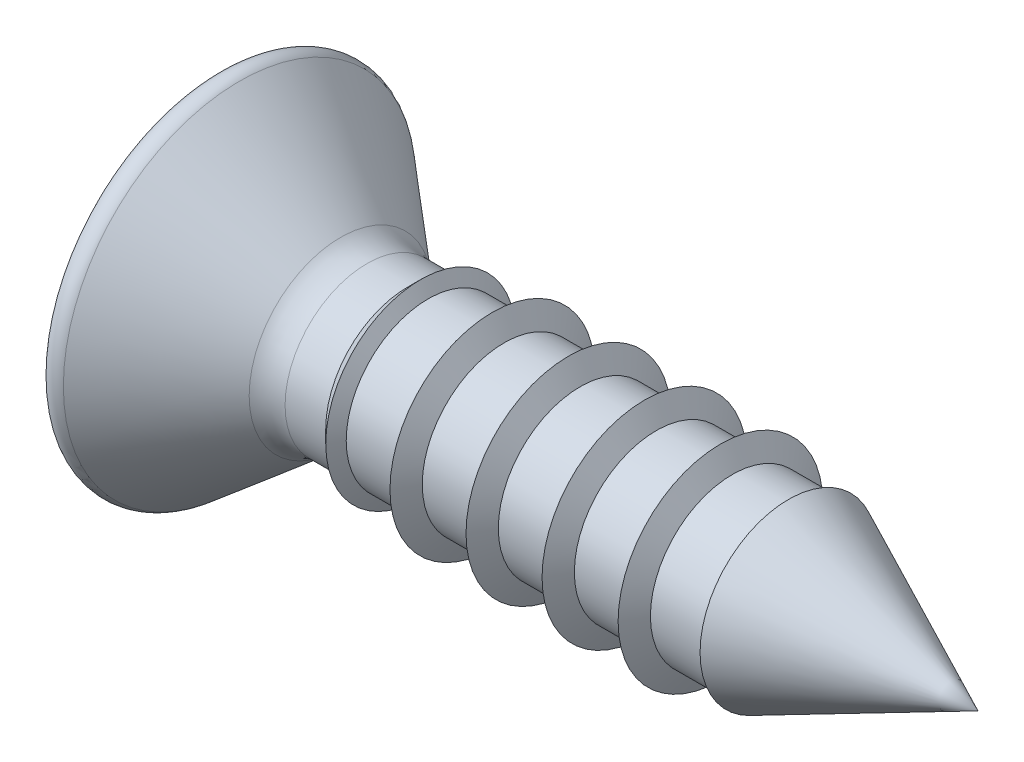
ISO-10303-21;
HEADER;
FILE_DESCRIPTION(('STEP AP214'),'2;1');
FILE_NAME('part.step','',(''),(''),'','','');
FILE_SCHEMA(('AUTOMOTIVE_DESIGN { 1 0 10303 214 1 1 1 1 }'));
ENDSEC;
DATA;
#1=APPLICATION_CONTEXT('core data for automotive mechanical design processes');
#2=APPLICATION_PROTOCOL_DEFINITION('international standard','automotive_design',2000,#1);
#3=PRODUCT_CONTEXT('',#1,'mechanical');
#4=PRODUCT('Part','Part','',(#3));
#5=PRODUCT_RELATED_PRODUCT_CATEGORY('part','',(#4));
#6=PRODUCT_DEFINITION_FORMATION('','',#4);
#7=PRODUCT_DEFINITION_CONTEXT('part definition',#1,'design');
#8=PRODUCT_DEFINITION('design','',#6,#7);
#9=PRODUCT_DEFINITION_SHAPE('','',#8);
#10=(LENGTH_UNIT() NAMED_UNIT(*) SI_UNIT(.MILLI.,.METRE.));
#11=(NAMED_UNIT(*) PLANE_ANGLE_UNIT() SI_UNIT($,.RADIAN.));
#12=(NAMED_UNIT(*) SI_UNIT($,.STERADIAN.) SOLID_ANGLE_UNIT());
#13=UNCERTAINTY_MEASURE_WITH_UNIT(LENGTH_MEASURE(1.E-05),#10,'distance_accuracy_value','');
#14=(GEOMETRIC_REPRESENTATION_CONTEXT(3) GLOBAL_UNCERTAINTY_ASSIGNED_CONTEXT((#13)) GLOBAL_UNIT_ASSIGNED_CONTEXT((#10,
#11,#12)) REPRESENTATION_CONTEXT('',''));
#15=CARTESIAN_POINT('',(0.,0.,0.));
#16=DIRECTION('',(0.,0.,1.));
#17=DIRECTION('',(1.,0.,0.));
#18=AXIS2_PLACEMENT_3D('',#15,#16,#17);
#19=CARTESIAN_POINT('',(9.69585481156726,0.,0.));
#20=DIRECTION('',(1.,0.,0.));
#21=DIRECTION('',(0.,0.,-1.));
#22=AXIS2_PLACEMENT_3D('',#19,#20,#21);
#23=CONICAL_SURFACE('',#22,1.4,1.0471975511966);
#24=CARTESIAN_POINT('',(9.69585481156726,0.,0.));
#25=DIRECTION('',(-1.,0.,0.));
#26=DIRECTION('',(0.,0.,1.));
#27=AXIS2_PLACEMENT_3D('',#24,#25,#26);
#28=CIRCLE('',#27,1.4);
#29=CARTESIAN_POINT('',(9.69585481156726,0.,1.4));
#30=VERTEX_POINT('',#29);
#31=EDGE_CURVE('E564',#30,#30,#28,.T.);
#32=ORIENTED_EDGE('',*,*,#31,.F.);
#33=EDGE_LOOP('',(#32));
#34=FACE_BOUND('',#33,.T.);
#35=CARTESIAN_POINT('',(9.75987904019815,0.,0.));
#36=DIRECTION('',(-1.,0.,0.));
#37=DIRECTION('',(0.,0.,1.));
#38=AXIS2_PLACEMENT_3D('',#35,#36,#37);
#39=CIRCLE('',#38,1.5108932169041);
#40=CARTESIAN_POINT('',(9.75987904019815,0.,1.5108932169041));
#41=VERTEX_POINT('',#40);
#42=EDGE_CURVE('E72',#41,#41,#39,.T.);
#43=ORIENTED_EDGE('',*,*,#42,.T.);
#44=EDGE_LOOP('',(#43));
#45=FACE_BOUND('',#44,.T.);
#46=ADVANCED_FACE('F68',(#34,#45),#23,.T.);
#47=CARTESIAN_POINT('',(3.6,0.,0.));
#48=DIRECTION('',(1.,0.,0.));
#49=DIRECTION('',(0.,0.,-1.));
#50=AXIS2_PLACEMENT_3D('',#47,#48,#49);
#51=CONICAL_SURFACE('',#50,1.75,0.785398163397443);
#52=CARTESIAN_POINT('',(3.25,0.,0.));
#53=DIRECTION('',(-1.,0.,0.));
#54=DIRECTION('',(0.,0.,1.));
#55=AXIS2_PLACEMENT_3D('',#52,#53,#54);
#56=CIRCLE('',#55,1.4);
#57=CARTESIAN_POINT('',(3.25,0.,1.4));
#58=VERTEX_POINT('',#57);
#59=EDGE_CURVE('E369',#58,#58,#56,.T.);
#60=ORIENTED_EDGE('',*,*,#59,.F.);
#61=EDGE_LOOP('',(#60));
#62=FACE_BOUND('',#61,.T.);
#63=CARTESIAN_POINT('',(3.47189110867544,0.,0.));
#64=DIRECTION('',(-1.,0.,0.));
#65=DIRECTION('',(0.,0.,1.));
#66=AXIS2_PLACEMENT_3D('',#63,#64,#65);
#67=CIRCLE('',#66,1.62189110867545);
#68=CARTESIAN_POINT('',(3.47189110867544,0.,1.62189110867545));
#69=VERTEX_POINT('',#68);
#70=EDGE_CURVE('E371',#69,#69,#67,.F.);
#71=ORIENTED_EDGE('',*,*,#70,.F.);
#72=EDGE_LOOP('',(#71));
#73=FACE_BOUND('',#72,.T.);
#74=ADVANCED_FACE('F199',(#62,#73),#51,.T.);
#75=CARTESIAN_POINT('',(2.10482783720576,0.,0.));
#76=DIRECTION('',(-1.,0.,0.));
#77=DIRECTION('',(0.,0.,1.));
#78=AXIS2_PLACEMENT_3D('',#75,#76,#77);
#79=CONICAL_SURFACE('',#78,1.56376888981672,0.698131700797733);
#80=CARTESIAN_POINT('',(2.10482783720576,0.,0.));
#81=DIRECTION('',(-1.,0.,0.));
#82=DIRECTION('',(0.,0.,1.));
#83=AXIS2_PLACEMENT_3D('',#80,#81,#82);
#84=CIRCLE('',#83,1.56376888981672);
#85=CARTESIAN_POINT('',(2.10482783720576,0.,1.56376888981672));
#86=VERTEX_POINT('',#85);
#87=EDGE_CURVE('E477',#86,#86,#84,.T.);
#88=ORIENTED_EDGE('',*,*,#87,.T.);
#89=EDGE_LOOP('',(#88));
#90=FACE_BOUND('',#89,.T.);
#91=CARTESIAN_POINT('',(0.377841150227904,0.,0.));
#92=DIRECTION('',(-1.,0.,0.));
#93=DIRECTION('',(0.,0.,1.));
#94=AXIS2_PLACEMENT_3D('',#91,#92,#93);
#95=CIRCLE('',#94,3.01288278190792);
#96=CARTESIAN_POINT('',(0.377841150227904,0.,3.01288278190792));
#97=VERTEX_POINT('',#96);
#98=EDGE_CURVE('E474',#97,#97,#95,.T.);
#99=ORIENTED_EDGE('',*,*,#98,.F.);
#100=EDGE_LOOP('',(#99));
#101=FACE_BOUND('',#100,.T.);
#102=ADVANCED_FACE('F204',(#90,#101),#79,.T.);
#103=CARTESIAN_POINT('',(0.,0.455,-2.03));
#104=DIRECTION('',(-0.342020143325669,0.,0.939692620785908));
#105=DIRECTION('',(0.939692620785908,0.,0.342020143325669));
#106=AXIS2_PLACEMENT_3D('',#103,#104,#105);
#107=PLANE('',#106);
#108=DIRECTION('',(-0.939692620785908,0.,-0.342020143325669));
#109=VECTOR('',#108,1.);
#110=CARTESIAN_POINT('',(0.,-0.455,-2.03));
#111=LINE('',#110,#109);
#112=CARTESIAN_POINT('',(2.10482783720576,-0.455,-1.26390531900219));
#113=VERTEX_POINT('',#112);
#114=CARTESIAN_POINT('',(0.,-0.455,-2.03));
#115=VERTEX_POINT('',#114);
#116=EDGE_CURVE('E367',#113,#115,#111,.T.);
#117=ORIENTED_EDGE('',*,*,#116,.F.);
#118=DIRECTION('',(0.,1.,0.));
#119=VECTOR('',#118,1.);
#120=CARTESIAN_POINT('',(2.10482783720576,0.455,-1.26390531900219));
#121=LINE('',#120,#119);
#122=CARTESIAN_POINT('',(2.10482783720576,0.455,-1.26390531900219));
#123=VERTEX_POINT('',#122);
#124=EDGE_CURVE('E42',#113,#123,#121,.T.);
#125=ORIENTED_EDGE('',*,*,#124,.T.);
#126=DIRECTION('',(-0.939692620785908,0.,-0.342020143325669));
#127=VECTOR('',#126,1.);
#128=CARTESIAN_POINT('',(1.85860975280969,0.455,-1.35352137286041));
#129=LINE('',#128,#127);
#130=CARTESIAN_POINT('',(0.,0.455,-2.03));
#131=VERTEX_POINT('',#130);
#132=EDGE_CURVE('E442',#123,#131,#129,.T.);
#133=ORIENTED_EDGE('',*,*,#132,.T.);
#134=DIRECTION('',(0.,1.,0.));
#135=VECTOR('',#134,1.);
#136=CARTESIAN_POINT('',(0.,0.455,-2.03));
#137=LINE('',#136,#135);
#138=EDGE_CURVE('E466',#115,#131,#137,.T.);
#139=ORIENTED_EDGE('',*,*,#138,.F.);
#140=EDGE_LOOP('',(#117,#125,#133,#139));
#141=FACE_BOUND('',#140,.T.);
#142=ADVANCED_FACE('F282',(#141),#107,.T.);
#143=CARTESIAN_POINT('',(2.10482783720576,0.455,-0.455000000000001));
#144=DIRECTION('',(-1.,0.,0.));
#145=DIRECTION('',(0.,0.,1.));
#146=AXIS2_PLACEMENT_3D('',#143,#144,#145);
#147=PLANE('',#146);
#148=DIRECTION('',(0.,-0.707106781186548,-0.707106781186547));
#149=VECTOR('',#148,1.);
#150=CARTESIAN_POINT('',(2.10482783720576,-0.861,0.455));
#151=LINE('',#150,#149);
#152=CARTESIAN_POINT('',(2.10482783720576,-0.455,0.861));
#153=VERTEX_POINT('',#152);
#154=CARTESIAN_POINT('',(2.10482783720576,-0.861,0.455));
#155=VERTEX_POINT('',#154);
#156=EDGE_CURVE('E391',#153,#155,#151,.T.);
#157=ORIENTED_EDGE('',*,*,#156,.F.);
#158=DIRECTION('',(0.,0.,-1.));
#159=VECTOR('',#158,1.);
#160=CARTESIAN_POINT('',(2.10482783720576,-0.455,0.454999999999999));
#161=LINE('',#160,#159);
#162=CARTESIAN_POINT('',(2.10482783720576,-0.455,1.26390531900219));
#163=VERTEX_POINT('',#162);
#164=EDGE_CURVE('E429',#163,#153,#161,.T.);
#165=ORIENTED_EDGE('',*,*,#164,.F.);
#166=DIRECTION('',(0.,-1.,0.));
#167=VECTOR('',#166,1.);
#168=CARTESIAN_POINT('',(2.10482783720576,0.455,1.26390531900219));
#169=LINE('',#168,#167);
#170=CARTESIAN_POINT('',(2.10482783720576,0.455,1.26390531900219));
#171=VERTEX_POINT('',#170);
#172=EDGE_CURVE('E349',#171,#163,#169,.T.);
#173=ORIENTED_EDGE('',*,*,#172,.F.);
#174=DIRECTION('',(0.,0.,1.));
#175=VECTOR('',#174,1.);
#176=CARTESIAN_POINT('',(2.10482783720576,0.455,0.455));
#177=LINE('',#176,#175);
#178=CARTESIAN_POINT('',(2.10482783720576,0.455,0.861));
#179=VERTEX_POINT('',#178);
#180=EDGE_CURVE('E427',#179,#171,#177,.T.);
#181=ORIENTED_EDGE('',*,*,#180,.F.);
#182=DIRECTION('',(0.,-0.707106781186548,0.707106781186547));
#183=VECTOR('',#182,1.);
#184=CARTESIAN_POINT('',(2.10482783720576,0.861,0.455));
#185=LINE('',#184,#183);
#186=CARTESIAN_POINT('',(2.10482783720576,0.861,0.455));
#187=VERTEX_POINT('',#186);
#188=EDGE_CURVE('E412',#187,#179,#185,.T.);
#189=ORIENTED_EDGE('',*,*,#188,.F.);
#190=DIRECTION('',(0.,-1.,0.));
#191=VECTOR('',#190,1.);
#192=CARTESIAN_POINT('',(2.10482783720576,2.03,0.455));
#193=LINE('',#192,#191);
#194=CARTESIAN_POINT('',(2.10482783720576,1.26390531900219,0.455));
#195=VERTEX_POINT('',#194);
#196=EDGE_CURVE('E423',#195,#187,#193,.T.);
#197=ORIENTED_EDGE('',*,*,#196,.F.);
#198=DIRECTION('',(0.,0.,1.));
#199=VECTOR('',#198,1.);
#200=CARTESIAN_POINT('',(2.10482783720576,1.26390531900219,-0.455000000000001));
#201=LINE('',#200,#199);
#202=CARTESIAN_POINT('',(2.10482783720576,1.26390531900219,-0.455));
#203=VERTEX_POINT('',#202);
#204=EDGE_CURVE('E77',#203,#195,#201,.T.);
#205=ORIENTED_EDGE('',*,*,#204,.F.);
#206=DIRECTION('',(0.,1.,0.));
#207=VECTOR('',#206,1.);
#208=CARTESIAN_POINT('',(2.10482783720576,2.03,-0.455));
#209=LINE('',#208,#207);
#210=CARTESIAN_POINT('',(2.10482783720576,0.861,-0.455));
#211=VERTEX_POINT('',#210);
#212=EDGE_CURVE('E421',#211,#203,#209,.T.);
#213=ORIENTED_EDGE('',*,*,#212,.F.);
#214=DIRECTION('',(0.,0.707106781186548,0.707106781186547));
#215=VECTOR('',#214,1.);
#216=CARTESIAN_POINT('',(2.10482783720576,0.861,-0.455));
#217=LINE('',#216,#215);
#218=CARTESIAN_POINT('',(2.10482783720576,0.455,-0.861));
#219=VERTEX_POINT('',#218);
#220=EDGE_CURVE('E85',#219,#211,#217,.T.);
#221=ORIENTED_EDGE('',*,*,#220,.F.);
#222=DIRECTION('',(0.,0.,1.));
#223=VECTOR('',#222,1.);
#224=CARTESIAN_POINT('',(2.10482783720576,0.455,-2.03));
#225=LINE('',#224,#223);
#226=EDGE_CURVE('E439',#123,#219,#225,.T.);
#227=ORIENTED_EDGE('',*,*,#226,.F.);
#228=ORIENTED_EDGE('',*,*,#124,.F.);
#229=DIRECTION('',(0.,0.,-1.));
#230=VECTOR('',#229,1.);
#231=CARTESIAN_POINT('',(2.10482783720576,-0.455,-2.03));
#232=LINE('',#231,#230);
#233=CARTESIAN_POINT('',(2.10482783720576,-0.455,-0.861));
#234=VERTEX_POINT('',#233);
#235=EDGE_CURVE('E437',#234,#113,#232,.T.);
#236=ORIENTED_EDGE('',*,*,#235,.F.);
#237=DIRECTION('',(0.,0.707106781186548,-0.707106781186547));
#238=VECTOR('',#237,1.);
#239=CARTESIAN_POINT('',(2.10482783720576,-0.861,-0.455));
#240=LINE('',#239,#238);
#241=CARTESIAN_POINT('',(2.10482783720576,-0.861,-0.455));
#242=VERTEX_POINT('',#241);
#243=EDGE_CURVE('E395',#242,#234,#240,.T.);
#244=ORIENTED_EDGE('',*,*,#243,.F.);
#245=DIRECTION('',(0.,1.,0.));
#246=VECTOR('',#245,1.);
#247=CARTESIAN_POINT('',(2.10482783720576,-0.455,-0.455));
#248=LINE('',#247,#246);
#249=CARTESIAN_POINT('',(2.10482783720576,-1.26390531900219,-0.455));
#250=VERTEX_POINT('',#249);
#251=EDGE_CURVE('E434',#250,#242,#248,.T.);
#252=ORIENTED_EDGE('',*,*,#251,.F.);
#253=DIRECTION('',(0.,0.,-1.));
#254=VECTOR('',#253,1.);
#255=CARTESIAN_POINT('',(2.10482783720576,-1.26390531900219,-0.455000000000001));
#256=LINE('',#255,#254);
#257=CARTESIAN_POINT('',(2.10482783720576,-1.26390531900219,0.455));
#258=VERTEX_POINT('',#257);
#259=EDGE_CURVE('E93',#258,#250,#256,.T.);
#260=ORIENTED_EDGE('',*,*,#259,.F.);
#261=DIRECTION('',(0.,-1.,0.));
#262=VECTOR('',#261,1.);
#263=CARTESIAN_POINT('',(2.10482783720576,-0.455,0.454999999999999));
#264=LINE('',#263,#262);
#265=EDGE_CURVE('E432',#155,#258,#264,.T.);
#266=ORIENTED_EDGE('',*,*,#265,.F.);
#267=EDGE_LOOP('',(#157,#165,#173,#181,#189,#197,#205,#213,#221,#227,#228,#236,#244,#252,#260,#266));
#268=FACE_BOUND('',#267,.T.);
#269=ADVANCED_FACE('F278',(#268),#147,.T.);
#270=CARTESIAN_POINT('',(0.,2.03,-0.455));
#271=DIRECTION('',(-0.342020143325669,-0.939692620785908,0.));
#272=DIRECTION('',(0.939692620785908,-0.342020143325669,0.));
#273=AXIS2_PLACEMENT_3D('',#270,#271,#272);
#274=PLANE('',#273);
#275=DIRECTION('',(-0.939692620785908,0.342020143325669,0.));
#276=VECTOR('',#275,1.);
#277=CARTESIAN_POINT('',(0.,2.03,-0.455));
#278=LINE('',#277,#276);
#279=CARTESIAN_POINT('',(0.,2.03,-0.455));
#280=VERTEX_POINT('',#279);
#281=EDGE_CURVE('E357',#203,#280,#278,.T.);
#282=ORIENTED_EDGE('',*,*,#281,.F.);
#283=ORIENTED_EDGE('',*,*,#204,.T.);
#284=DIRECTION('',(-0.939692620785908,0.342020143325669,0.));
#285=VECTOR('',#284,1.);
#286=CARTESIAN_POINT('',(1.85860975280969,1.35352137286041,0.455));
#287=LINE('',#286,#285);
#288=CARTESIAN_POINT('',(0.,2.03,0.455));
#289=VERTEX_POINT('',#288);
#290=EDGE_CURVE('E354',#195,#289,#287,.T.);
#291=ORIENTED_EDGE('',*,*,#290,.T.);
#292=DIRECTION('',(0.,0.,1.));
#293=VECTOR('',#292,1.);
#294=CARTESIAN_POINT('',(0.,2.03,-0.455));
#295=LINE('',#294,#293);
#296=EDGE_CURVE('E444',#280,#289,#295,.T.);
#297=ORIENTED_EDGE('',*,*,#296,.F.);
#298=EDGE_LOOP('',(#282,#283,#291,#297));
#299=FACE_BOUND('',#298,.T.);
#300=ADVANCED_FACE('F281',(#299),#274,.T.);
#301=CARTESIAN_POINT('',(0.,0.455,2.03));
#302=DIRECTION('',(-0.342020143325669,0.,-0.939692620785908));
#303=DIRECTION('',(-0.939692620785908,0.,0.342020143325669));
#304=AXIS2_PLACEMENT_3D('',#301,#302,#303);
#305=PLANE('',#304);
#306=DIRECTION('',(-0.939692620785908,0.,0.342020143325669));
#307=VECTOR('',#306,1.);
#308=CARTESIAN_POINT('',(0.,0.455,2.03));
#309=LINE('',#308,#307);
#310=CARTESIAN_POINT('',(0.,0.455,2.03));
#311=VERTEX_POINT('',#310);
#312=EDGE_CURVE('E347',#171,#311,#309,.T.);
#313=ORIENTED_EDGE('',*,*,#312,.F.);
#314=ORIENTED_EDGE('',*,*,#172,.T.);
#315=DIRECTION('',(-0.939692620785908,0.,0.342020143325669));
#316=VECTOR('',#315,1.);
#317=CARTESIAN_POINT('',(2.36480499543784,-0.455,1.1692813718166));
#318=LINE('',#317,#316);
#319=CARTESIAN_POINT('',(0.,-0.455,2.03));
#320=VERTEX_POINT('',#319);
#321=EDGE_CURVE('E355',#163,#320,#318,.T.);
#322=ORIENTED_EDGE('',*,*,#321,.T.);
#323=DIRECTION('',(0.,-1.,0.));
#324=VECTOR('',#323,1.);
#325=CARTESIAN_POINT('',(0.,0.455,2.03));
#326=LINE('',#325,#324);
#327=EDGE_CURVE('E352',#311,#320,#326,.T.);
#328=ORIENTED_EDGE('',*,*,#327,.F.);
#329=EDGE_LOOP('',(#313,#314,#322,#328));
#330=FACE_BOUND('',#329,.T.);
#331=ADVANCED_FACE('F337',(#330),#305,.T.);
#332=CARTESIAN_POINT('',(0.,-2.03,-0.455));
#333=DIRECTION('',(-0.342020143325669,0.939692620785908,0.));
#334=DIRECTION('',(-0.939692620785908,-0.342020143325669,0.));
#335=AXIS2_PLACEMENT_3D('',#332,#333,#334);
#336=PLANE('',#335);
#337=DIRECTION('',(-0.939692620785908,-0.342020143325669,0.));
#338=VECTOR('',#337,1.);
#339=CARTESIAN_POINT('',(0.,-2.03,0.455));
#340=LINE('',#339,#338);
#341=CARTESIAN_POINT('',(0.,-2.03,0.455));
#342=VERTEX_POINT('',#341);
#343=EDGE_CURVE('E359',#258,#342,#340,.T.);
#344=ORIENTED_EDGE('',*,*,#343,.F.);
#345=ORIENTED_EDGE('',*,*,#259,.T.);
#346=DIRECTION('',(-0.939692620785908,-0.342020143325669,0.));
#347=VECTOR('',#346,1.);
#348=CARTESIAN_POINT('',(2.36480499543784,-1.1692813718166,-0.455));
#349=LINE('',#348,#347);
#350=CARTESIAN_POINT('',(0.,-2.03,-0.455));
#351=VERTEX_POINT('',#350);
#352=EDGE_CURVE('E365',#250,#351,#349,.T.);
#353=ORIENTED_EDGE('',*,*,#352,.T.);
#354=DIRECTION('',(0.,0.,-1.));
#355=VECTOR('',#354,1.);
#356=CARTESIAN_POINT('',(0.,-2.03,-0.455));
#357=LINE('',#356,#355);
#358=EDGE_CURVE('E458',#342,#351,#357,.T.);
#359=ORIENTED_EDGE('',*,*,#358,.F.);
#360=EDGE_LOOP('',(#344,#345,#353,#359));
#361=FACE_BOUND('',#360,.T.);
#362=ADVANCED_FACE('F70',(#361),#336,.T.);
#363=CARTESIAN_POINT('',(0.,0.,0.));
#364=DIRECTION('',(1.,0.,0.));
#365=DIRECTION('',(0.,0.,-1.));
#366=AXIS2_PLACEMENT_3D('',#363,#364,#365);
#367=PLANE('',#366);
#368=CARTESIAN_POINT('',(0.,0.,0.));
#369=DIRECTION('',(-1.,0.,0.));
#370=DIRECTION('',(0.,0.,1.));
#371=AXIS2_PLACEMENT_3D('',#368,#369,#370);
#372=CIRCLE('',#371,2.83669255999055);
#373=CARTESIAN_POINT('',(0.,0.,2.83669255999055));
#374=VERTEX_POINT('',#373);
#375=EDGE_CURVE('E471',#374,#374,#372,.T.);
#376=ORIENTED_EDGE('',*,*,#375,.T.);
#377=EDGE_LOOP('',(#376));
#378=FACE_BOUND('',#377,.T.);
#379=DIRECTION('',(0.,0.,-1.));
#380=VECTOR('',#379,1.);
#381=CARTESIAN_POINT('',(0.,-0.455,0.454999999999999));
#382=LINE('',#381,#380);
#383=CARTESIAN_POINT('',(0.,-0.455,0.861));
#384=VERTEX_POINT('',#383);
#385=EDGE_CURVE('E453',#320,#384,#382,.T.);
#386=ORIENTED_EDGE('',*,*,#385,.T.);
#387=DIRECTION('',(0.,0.707106781186548,0.707106781186547));
#388=VECTOR('',#387,1.);
#389=CARTESIAN_POINT('',(0.,-0.861,0.455));
#390=LINE('',#389,#388);
#391=CARTESIAN_POINT('',(0.,-0.861,0.455));
#392=VERTEX_POINT('',#391);
#393=EDGE_CURVE('E373',#392,#384,#390,.T.);
#394=ORIENTED_EDGE('',*,*,#393,.F.);
#395=DIRECTION('',(0.,-1.,0.));
#396=VECTOR('',#395,1.);
#397=CARTESIAN_POINT('',(0.,-0.455,0.454999999999999));
#398=LINE('',#397,#396);
#399=EDGE_CURVE('E456',#392,#342,#398,.T.);
#400=ORIENTED_EDGE('',*,*,#399,.T.);
#401=ORIENTED_EDGE('',*,*,#358,.T.);
#402=DIRECTION('',(0.,1.,0.));
#403=VECTOR('',#402,1.);
#404=CARTESIAN_POINT('',(0.,-0.455,-0.455));
#405=LINE('',#404,#403);
#406=CARTESIAN_POINT('',(0.,-0.861,-0.455));
#407=VERTEX_POINT('',#406);
#408=EDGE_CURVE('E461',#351,#407,#405,.T.);
#409=ORIENTED_EDGE('',*,*,#408,.T.);
#410=DIRECTION('',(0.,-0.707106781186548,0.707106781186547));
#411=VECTOR('',#410,1.);
#412=CARTESIAN_POINT('',(0.,-0.861,-0.455));
#413=LINE('',#412,#411);
#414=CARTESIAN_POINT('',(0.,-0.455,-0.861));
#415=VERTEX_POINT('',#414);
#416=EDGE_CURVE('E394',#415,#407,#413,.T.);
#417=ORIENTED_EDGE('',*,*,#416,.F.);
#418=DIRECTION('',(0.,0.,-1.));
#419=VECTOR('',#418,1.);
#420=CARTESIAN_POINT('',(0.,-0.455,-2.03));
#421=LINE('',#420,#419);
#422=EDGE_CURVE('E464',#415,#115,#421,.T.);
#423=ORIENTED_EDGE('',*,*,#422,.T.);
#424=ORIENTED_EDGE('',*,*,#138,.T.);
#425=DIRECTION('',(0.,0.,1.));
#426=VECTOR('',#425,1.);
#427=CARTESIAN_POINT('',(0.,0.455,-2.03));
#428=LINE('',#427,#426);
#429=CARTESIAN_POINT('',(0.,0.455,-0.861));
#430=VERTEX_POINT('',#429);
#431=EDGE_CURVE('E424',#131,#430,#428,.T.);
#432=ORIENTED_EDGE('',*,*,#431,.T.);
#433=DIRECTION('',(0.,-0.707106781186548,-0.707106781186547));
#434=VECTOR('',#433,1.);
#435=CARTESIAN_POINT('',(0.,0.861,-0.455));
#436=LINE('',#435,#434);
#437=CARTESIAN_POINT('',(0.,0.861,-0.455));
#438=VERTEX_POINT('',#437);
#439=EDGE_CURVE('E397',#438,#430,#436,.T.);
#440=ORIENTED_EDGE('',*,*,#439,.F.);
#441=DIRECTION('',(0.,1.,0.));
#442=VECTOR('',#441,1.);
#443=CARTESIAN_POINT('',(0.,2.03,-0.455));
#444=LINE('',#443,#442);
#445=EDGE_CURVE('E414',#438,#280,#444,.T.);
#446=ORIENTED_EDGE('',*,*,#445,.T.);
#447=ORIENTED_EDGE('',*,*,#296,.T.);
#448=DIRECTION('',(0.,-1.,0.));
#449=VECTOR('',#448,1.);
#450=CARTESIAN_POINT('',(0.,2.03,0.455));
#451=LINE('',#450,#449);
#452=CARTESIAN_POINT('',(0.,0.861,0.455));
#453=VERTEX_POINT('',#452);
#454=EDGE_CURVE('E447',#289,#453,#451,.T.);
#455=ORIENTED_EDGE('',*,*,#454,.T.);
#456=DIRECTION('',(0.,0.707106781186548,-0.707106781186547));
#457=VECTOR('',#456,1.);
#458=CARTESIAN_POINT('',(0.,0.861,0.455));
#459=LINE('',#458,#457);
#460=CARTESIAN_POINT('',(0.,0.455,0.861));
#461=VERTEX_POINT('',#460);
#462=EDGE_CURVE('E411',#461,#453,#459,.T.);
#463=ORIENTED_EDGE('',*,*,#462,.F.);
#464=DIRECTION('',(0.,0.,1.));
#465=VECTOR('',#464,1.);
#466=CARTESIAN_POINT('',(0.,0.455,0.455));
#467=LINE('',#466,#465);
#468=EDGE_CURVE('E450',#461,#311,#467,.T.);
#469=ORIENTED_EDGE('',*,*,#468,.T.);
#470=ORIENTED_EDGE('',*,*,#327,.T.);
#471=EDGE_LOOP('',(#386,#394,#400,#401,#409,#417,#423,#424,#432,#440,#446,#447,#455,#463,#469,#470));
#472=FACE_BOUND('',#471,.T.);
#473=ADVANCED_FACE('F315',(#378,#472),#367,.F.);
#474=CARTESIAN_POINT('',(0.,0.,0.));
#475=DIRECTION('',(-1.,0.,0.));
#476=DIRECTION('',(0.,0.,1.));
#477=AXIS2_PLACEMENT_3D('',#474,#475,#476);
#478=CYLINDRICAL_SURFACE('',#477,1.4);
#479=CARTESIAN_POINT('',(2.55477916398634,0.,0.));
#480=DIRECTION('',(-1.,0.,0.));
#481=DIRECTION('',(0.,0.,1.));
#482=AXIS2_PLACEMENT_3D('',#479,#480,#481);
#483=CIRCLE('',#482,1.4);
#484=CARTESIAN_POINT('',(2.55477916398634,0.,1.4));
#485=VERTEX_POINT('',#484);
#486=EDGE_CURVE('E480',#485,#485,#483,.T.);
#487=ORIENTED_EDGE('',*,*,#486,.F.);
#488=EDGE_LOOP('',(#487));
#489=FACE_BOUND('',#488,.T.);
#490=ORIENTED_EDGE('',*,*,#59,.T.);
#491=EDGE_LOOP('',(#490));
#492=FACE_BOUND('',#491,.T.);
#493=ADVANCED_FACE('F318',(#489,#492),#478,.T.);
#494=CARTESIAN_POINT('',(2.55477916398634,0.,0.));
#495=DIRECTION('',(-1.,0.,0.));
#496=DIRECTION('',(0.,0.,1.));
#497=AXIS2_PLACEMENT_3D('',#494,#495,#496);
#498=TOROIDAL_SURFACE('',#497,2.1,0.7);
#499=ORIENTED_EDGE('',*,*,#87,.F.);
#500=EDGE_LOOP('',(#499));
#501=FACE_BOUND('',#500,.T.);
#502=ORIENTED_EDGE('',*,*,#486,.T.);
#503=EDGE_LOOP('',(#502));
#504=FACE_BOUND('',#503,.T.);
#505=ADVANCED_FACE('F322',(#501,#504),#498,.F.);
#506=CARTESIAN_POINT('',(0.23,0.,0.));
#507=DIRECTION('',(-1.,0.,0.));
#508=DIRECTION('',(0.,0.,1.));
#509=AXIS2_PLACEMENT_3D('',#506,#507,#508);
#510=TOROIDAL_SURFACE('',#509,2.83669255999055,0.23);
#511=ORIENTED_EDGE('',*,*,#375,.F.);
#512=EDGE_LOOP('',(#511));
#513=FACE_BOUND('',#512,.T.);
#514=ORIENTED_EDGE('',*,*,#98,.T.);
#515=EDGE_LOOP('',(#514));
#516=FACE_BOUND('',#515,.T.);
#517=ADVANCED_FACE('F313',(#513,#516),#510,.T.);
#518=CARTESIAN_POINT('',(2.10482783720576,2.03,-0.455));
#519=DIRECTION('',(0.,0.,1.));
#520=DIRECTION('',(1.,0.,0.));
#521=AXIS2_PLACEMENT_3D('',#518,#519,#520);
#522=PLANE('',#521);
#523=DIRECTION('',(-1.,0.,0.));
#524=VECTOR('',#523,1.);
#525=CARTESIAN_POINT('',(2.67899854352924,0.861,-0.455));
#526=LINE('',#525,#524);
#527=EDGE_CURVE('E405',#211,#438,#526,.T.);
#528=ORIENTED_EDGE('',*,*,#527,.F.);
#529=ORIENTED_EDGE('',*,*,#212,.T.);
#530=ORIENTED_EDGE('',*,*,#281,.T.);
#531=ORIENTED_EDGE('',*,*,#445,.F.);
#532=EDGE_LOOP('',(#528,#529,#530,#531));
#533=FACE_BOUND('',#532,.T.);
#534=ADVANCED_FACE('F309',(#533),#522,.T.);
#535=CARTESIAN_POINT('',(2.10482783720576,2.03,0.455));
#536=DIRECTION('',(0.,0.,-1.));
#537=DIRECTION('',(0.,1.,0.));
#538=AXIS2_PLACEMENT_3D('',#535,#536,#537);
#539=PLANE('',#538);
#540=DIRECTION('',(-1.,0.,0.));
#541=VECTOR('',#540,1.);
#542=CARTESIAN_POINT('',(2.67899854352924,0.861,0.455));
#543=LINE('',#542,#541);
#544=EDGE_CURVE('E415',#187,#453,#543,.T.);
#545=ORIENTED_EDGE('',*,*,#544,.T.);
#546=ORIENTED_EDGE('',*,*,#454,.F.);
#547=ORIENTED_EDGE('',*,*,#290,.F.);
#548=ORIENTED_EDGE('',*,*,#196,.T.);
#549=EDGE_LOOP('',(#545,#546,#547,#548));
#550=FACE_BOUND('',#549,.T.);
#551=ADVANCED_FACE('F305',(#550),#539,.T.);
#552=CARTESIAN_POINT('',(2.10482783720576,0.455,0.455));
#553=DIRECTION('',(0.,-1.,0.));
#554=DIRECTION('',(0.,0.,-1.));
#555=AXIS2_PLACEMENT_3D('',#552,#553,#554);
#556=PLANE('',#555);
#557=DIRECTION('',(-1.,0.,0.));
#558=VECTOR('',#557,1.);
#559=CARTESIAN_POINT('',(2.67899854352924,0.455,0.861));
#560=LINE('',#559,#558);
#561=EDGE_CURVE('E417',#179,#461,#560,.T.);
#562=ORIENTED_EDGE('',*,*,#561,.F.);
#563=ORIENTED_EDGE('',*,*,#180,.T.);
#564=ORIENTED_EDGE('',*,*,#312,.T.);
#565=ORIENTED_EDGE('',*,*,#468,.F.);
#566=EDGE_LOOP('',(#562,#563,#564,#565));
#567=FACE_BOUND('',#566,.T.);
#568=ADVANCED_FACE('F301',(#567),#556,.T.);
#569=CARTESIAN_POINT('',(2.10482783720576,-0.455,0.454999999999999));
#570=DIRECTION('',(0.,1.,0.));
#571=DIRECTION('',(0.,0.,1.));
#572=AXIS2_PLACEMENT_3D('',#569,#570,#571);
#573=PLANE('',#572);
#574=DIRECTION('',(-1.,0.,0.));
#575=VECTOR('',#574,1.);
#576=CARTESIAN_POINT('',(2.67899854352924,-0.455,0.861));
#577=LINE('',#576,#575);
#578=EDGE_CURVE('E388',#153,#384,#577,.T.);
#579=ORIENTED_EDGE('',*,*,#578,.T.);
#580=ORIENTED_EDGE('',*,*,#385,.F.);
#581=ORIENTED_EDGE('',*,*,#321,.F.);
#582=ORIENTED_EDGE('',*,*,#164,.T.);
#583=EDGE_LOOP('',(#579,#580,#581,#582));
#584=FACE_BOUND('',#583,.T.);
#585=ADVANCED_FACE('F297',(#584),#573,.T.);
#586=CARTESIAN_POINT('',(2.10482783720576,-0.455,0.454999999999999));
#587=DIRECTION('',(0.,0.,-1.));
#588=DIRECTION('',(0.,1.,0.));
#589=AXIS2_PLACEMENT_3D('',#586,#587,#588);
#590=PLANE('',#589);
#591=DIRECTION('',(-1.,0.,0.));
#592=VECTOR('',#591,1.);
#593=CARTESIAN_POINT('',(2.67899854352924,-0.861,0.455));
#594=LINE('',#593,#592);
#595=EDGE_CURVE('E377',#155,#392,#594,.T.);
#596=ORIENTED_EDGE('',*,*,#595,.F.);
#597=ORIENTED_EDGE('',*,*,#265,.T.);
#598=ORIENTED_EDGE('',*,*,#343,.T.);
#599=ORIENTED_EDGE('',*,*,#399,.F.);
#600=EDGE_LOOP('',(#596,#597,#598,#599));
#601=FACE_BOUND('',#600,.T.);
#602=ADVANCED_FACE('F293',(#601),#590,.T.);
#603=CARTESIAN_POINT('',(2.10482783720576,-0.455,-0.455));
#604=DIRECTION('',(0.,0.,1.));
#605=DIRECTION('',(1.,0.,0.));
#606=AXIS2_PLACEMENT_3D('',#603,#604,#605);
#607=PLANE('',#606);
#608=DIRECTION('',(-1.,0.,0.));
#609=VECTOR('',#608,1.);
#610=CARTESIAN_POINT('',(2.67899854352924,-0.861,-0.455));
#611=LINE('',#610,#609);
#612=EDGE_CURVE('E398',#242,#407,#611,.T.);
#613=ORIENTED_EDGE('',*,*,#612,.T.);
#614=ORIENTED_EDGE('',*,*,#408,.F.);
#615=ORIENTED_EDGE('',*,*,#352,.F.);
#616=ORIENTED_EDGE('',*,*,#251,.T.);
#617=EDGE_LOOP('',(#613,#614,#615,#616));
#618=FACE_BOUND('',#617,.T.);
#619=ADVANCED_FACE('F289',(#618),#607,.T.);
#620=CARTESIAN_POINT('',(2.10482783720576,-0.455,-2.03));
#621=DIRECTION('',(0.,1.,0.));
#622=DIRECTION('',(0.,0.,1.));
#623=AXIS2_PLACEMENT_3D('',#620,#621,#622);
#624=PLANE('',#623);
#625=DIRECTION('',(-1.,0.,0.));
#626=VECTOR('',#625,1.);
#627=CARTESIAN_POINT('',(2.67899854352924,-0.455,-0.861));
#628=LINE('',#627,#626);
#629=EDGE_CURVE('E400',#234,#415,#628,.T.);
#630=ORIENTED_EDGE('',*,*,#629,.F.);
#631=ORIENTED_EDGE('',*,*,#235,.T.);
#632=ORIENTED_EDGE('',*,*,#116,.T.);
#633=ORIENTED_EDGE('',*,*,#422,.F.);
#634=EDGE_LOOP('',(#630,#631,#632,#633));
#635=FACE_BOUND('',#634,.T.);
#636=ADVANCED_FACE('F285',(#635),#624,.T.);
#637=CARTESIAN_POINT('',(2.10482783720576,0.455,-2.03));
#638=DIRECTION('',(0.,-1.,0.));
#639=DIRECTION('',(0.,0.,-1.));
#640=AXIS2_PLACEMENT_3D('',#637,#638,#639);
#641=PLANE('',#640);
#642=DIRECTION('',(-1.,0.,0.));
#643=VECTOR('',#642,1.);
#644=CARTESIAN_POINT('',(2.67899854352924,0.455,-0.861));
#645=LINE('',#644,#643);
#646=EDGE_CURVE('E406',#219,#430,#645,.T.);
#647=ORIENTED_EDGE('',*,*,#646,.T.);
#648=ORIENTED_EDGE('',*,*,#431,.F.);
#649=ORIENTED_EDGE('',*,*,#132,.F.);
#650=ORIENTED_EDGE('',*,*,#226,.T.);
#651=EDGE_LOOP('',(#647,#648,#649,#650));
#652=FACE_BOUND('',#651,.T.);
#653=ADVANCED_FACE('F276',(#652),#641,.T.);
#654=CARTESIAN_POINT('',(2.67899854352924,0.861,0.455));
#655=DIRECTION('',(0.,0.707106781186547,0.707106781186548));
#656=DIRECTION('',(0.,-0.707106781186548,0.707106781186547));
#657=AXIS2_PLACEMENT_3D('',#654,#655,#656);
#658=PLANE('',#657);
#659=ORIENTED_EDGE('',*,*,#188,.T.);
#660=ORIENTED_EDGE('',*,*,#561,.T.);
#661=ORIENTED_EDGE('',*,*,#462,.T.);
#662=ORIENTED_EDGE('',*,*,#544,.F.);
#663=EDGE_LOOP('',(#659,#660,#661,#662));
#664=FACE_BOUND('',#663,.T.);
#665=ADVANCED_FACE('F272',(#664),#658,.F.);
#666=CARTESIAN_POINT('',(2.67899854352924,0.861,-0.455));
#667=DIRECTION('',(0.,0.707106781186547,-0.707106781186548));
#668=DIRECTION('',(0.,0.707106781186548,0.707106781186547));
#669=AXIS2_PLACEMENT_3D('',#666,#667,#668);
#670=PLANE('',#669);
#671=ORIENTED_EDGE('',*,*,#220,.T.);
#672=ORIENTED_EDGE('',*,*,#527,.T.);
#673=ORIENTED_EDGE('',*,*,#439,.T.);
#674=ORIENTED_EDGE('',*,*,#646,.F.);
#675=EDGE_LOOP('',(#671,#672,#673,#674));
#676=FACE_BOUND('',#675,.T.);
#677=ADVANCED_FACE('F268',(#676),#670,.F.);
#678=CARTESIAN_POINT('',(2.67899854352924,-0.861,-0.455));
#679=DIRECTION('',(0.,-0.707106781186547,-0.707106781186548));
#680=DIRECTION('',(0.,0.707106781186548,-0.707106781186547));
#681=AXIS2_PLACEMENT_3D('',#678,#679,#680);
#682=PLANE('',#681);
#683=ORIENTED_EDGE('',*,*,#243,.T.);
#684=ORIENTED_EDGE('',*,*,#629,.T.);
#685=ORIENTED_EDGE('',*,*,#416,.T.);
#686=ORIENTED_EDGE('',*,*,#612,.F.);
#687=EDGE_LOOP('',(#683,#684,#685,#686));
#688=FACE_BOUND('',#687,.T.);
#689=ADVANCED_FACE('F264',(#688),#682,.F.);
#690=CARTESIAN_POINT('',(2.67899854352924,-0.861,0.455));
#691=DIRECTION('',(0.,-0.707106781186547,0.707106781186548));
#692=DIRECTION('',(0.,-0.707106781186548,-0.707106781186547));
#693=AXIS2_PLACEMENT_3D('',#690,#691,#692);
#694=PLANE('',#693);
#695=ORIENTED_EDGE('',*,*,#156,.T.);
#696=ORIENTED_EDGE('',*,*,#595,.T.);
#697=ORIENTED_EDGE('',*,*,#393,.T.);
#698=ORIENTED_EDGE('',*,*,#578,.F.);
#699=EDGE_LOOP('',(#695,#696,#697,#698));
#700=FACE_BOUND('',#699,.T.);
#701=ADVANCED_FACE('F260',(#700),#694,.F.);
#702=CARTESIAN_POINT('',(3.39792740578363,0.,0.));
#703=DIRECTION('',(-1.,0.,0.));
#704=DIRECTION('',(0.,0.,1.));
#705=AXIS2_PLACEMENT_3D('',#702,#703,#704);
#706=CONICAL_SURFACE('',#705,1.75,1.0471975511966);
#707=CARTESIAN_POINT('',(3.6,0.,0.));
#708=DIRECTION('',(-1.,0.,0.));
#709=DIRECTION('',(0.,0.,1.));
#710=AXIS2_PLACEMENT_3D('',#707,#708,#709);
#711=CIRCLE('',#710,1.4);
#712=CARTESIAN_POINT('',(3.6,0.,1.4));
#713=VERTEX_POINT('',#712);
#714=EDGE_CURVE('E374',#713,#713,#711,.T.);
#715=ORIENTED_EDGE('',*,*,#714,.T.);
#716=EDGE_LOOP('',(#715));
#717=FACE_BOUND('',#716,.T.);
#718=ORIENTED_EDGE('',*,*,#70,.T.);
#719=EDGE_LOOP('',(#718));
#720=FACE_BOUND('',#719,.T.);
#721=ADVANCED_FACE('F256',(#717,#720),#706,.T.);
#722=CARTESIAN_POINT('',(0.,0.,0.));
#723=DIRECTION('',(-1.,0.,0.));
#724=DIRECTION('',(0.,0.,1.));
#725=AXIS2_PLACEMENT_3D('',#722,#723,#724);
#726=CYLINDRICAL_SURFACE('',#725,1.4);
#727=CARTESIAN_POINT('',(4.49585481156726,0.,0.));
#728=DIRECTION('',(-1.,0.,0.));
#729=DIRECTION('',(0.,0.,1.));
#730=AXIS2_PLACEMENT_3D('',#727,#728,#729);
#731=CIRCLE('',#730,1.4);
#732=CARTESIAN_POINT('',(4.49585481156726,0.,1.4));
#733=VERTEX_POINT('',#732);
#734=EDGE_CURVE('E380',#733,#733,#731,.T.);
#735=ORIENTED_EDGE('',*,*,#734,.T.);
#736=EDGE_LOOP('',(#735));
#737=FACE_BOUND('',#736,.T.);
#738=ORIENTED_EDGE('',*,*,#714,.F.);
#739=EDGE_LOOP('',(#738));
#740=FACE_BOUND('',#739,.T.);
#741=ADVANCED_FACE('F252',(#737,#740),#726,.T.);
#742=CARTESIAN_POINT('',(4.49585481156726,0.,0.));
#743=DIRECTION('',(1.,0.,0.));
#744=DIRECTION('',(0.,0.,-1.));
#745=AXIS2_PLACEMENT_3D('',#742,#743,#744);
#746=CONICAL_SURFACE('',#745,1.4,1.0471975511966);
#747=CARTESIAN_POINT('',(4.69792740578363,0.,0.));
#748=DIRECTION('',(-1.,0.,0.));
#749=DIRECTION('',(0.,0.,1.));
#750=AXIS2_PLACEMENT_3D('',#747,#748,#749);
#751=CIRCLE('',#750,1.75);
#752=CARTESIAN_POINT('',(4.69792740578363,0.,1.75));
#753=VERTEX_POINT('',#752);
#754=EDGE_CURVE('E384',#753,#753,#751,.T.);
#755=ORIENTED_EDGE('',*,*,#754,.T.);
#756=EDGE_LOOP('',(#755));
#757=FACE_BOUND('',#756,.T.);
#758=ORIENTED_EDGE('',*,*,#734,.F.);
#759=EDGE_LOOP('',(#758));
#760=FACE_BOUND('',#759,.T.);
#761=ADVANCED_FACE('F248',(#757,#760),#746,.T.);
#762=CARTESIAN_POINT('',(4.69792740578363,0.,0.));
#763=DIRECTION('',(-1.,0.,0.));
#764=DIRECTION('',(0.,0.,1.));
#765=AXIS2_PLACEMENT_3D('',#762,#763,#764);
#766=CONICAL_SURFACE('',#765,1.75,1.0471975511966);
#767=CARTESIAN_POINT('',(4.9,0.,0.));
#768=DIRECTION('',(-1.,0.,0.));
#769=DIRECTION('',(0.,0.,1.));
#770=AXIS2_PLACEMENT_3D('',#767,#768,#769);
#771=CIRCLE('',#770,1.4);
#772=CARTESIAN_POINT('',(4.9,0.,1.4));
#773=VERTEX_POINT('',#772);
#774=EDGE_CURVE('E534',#773,#773,#771,.T.);
#775=ORIENTED_EDGE('',*,*,#774,.T.);
#776=EDGE_LOOP('',(#775));
#777=FACE_BOUND('',#776,.T.);
#778=ORIENTED_EDGE('',*,*,#754,.F.);
#779=EDGE_LOOP('',(#778));
#780=FACE_BOUND('',#779,.T.);
#781=ADVANCED_FACE('F244',(#777,#780),#766,.T.);
#782=CARTESIAN_POINT('',(1.3,0.,0.));
#783=DIRECTION('',(-1.,0.,0.));
#784=DIRECTION('',(0.,0.,1.));
#785=AXIS2_PLACEMENT_3D('',#782,#783,#784);
#786=CYLINDRICAL_SURFACE('',#785,1.4);
#787=CARTESIAN_POINT('',(5.79585481156726,0.,0.));
#788=DIRECTION('',(-1.,0.,0.));
#789=DIRECTION('',(0.,0.,1.));
#790=AXIS2_PLACEMENT_3D('',#787,#788,#789);
#791=CIRCLE('',#790,1.4);
#792=CARTESIAN_POINT('',(5.79585481156726,0.,1.4));
#793=VERTEX_POINT('',#792);
#794=EDGE_CURVE('E537',#793,#793,#791,.T.);
#795=ORIENTED_EDGE('',*,*,#794,.T.);
#796=EDGE_LOOP('',(#795));
#797=FACE_BOUND('',#796,.T.);
#798=ORIENTED_EDGE('',*,*,#774,.F.);
#799=EDGE_LOOP('',(#798));
#800=FACE_BOUND('',#799,.T.);
#801=ADVANCED_FACE('F240',(#797,#800),#786,.T.);
#802=CARTESIAN_POINT('',(5.79585481156726,0.,0.));
#803=DIRECTION('',(1.,0.,0.));
#804=DIRECTION('',(0.,0.,-1.));
#805=AXIS2_PLACEMENT_3D('',#802,#803,#804);
#806=CONICAL_SURFACE('',#805,1.4,1.0471975511966);
#807=CARTESIAN_POINT('',(5.99792740578363,0.,0.));
#808=DIRECTION('',(-1.,0.,0.));
#809=DIRECTION('',(0.,0.,1.));
#810=AXIS2_PLACEMENT_3D('',#807,#808,#809);
#811=CIRCLE('',#810,1.75);
#812=CARTESIAN_POINT('',(5.99792740578363,0.,1.75));
#813=VERTEX_POINT('',#812);
#814=EDGE_CURVE('E540',#813,#813,#811,.T.);
#815=ORIENTED_EDGE('',*,*,#814,.T.);
#816=EDGE_LOOP('',(#815));
#817=FACE_BOUND('',#816,.T.);
#818=ORIENTED_EDGE('',*,*,#794,.F.);
#819=EDGE_LOOP('',(#818));
#820=FACE_BOUND('',#819,.T.);
#821=ADVANCED_FACE('F236',(#817,#820),#806,.T.);
#822=CARTESIAN_POINT('',(5.99792740578363,0.,0.));
#823=DIRECTION('',(-1.,0.,0.));
#824=DIRECTION('',(0.,0.,1.));
#825=AXIS2_PLACEMENT_3D('',#822,#823,#824);
#826=CONICAL_SURFACE('',#825,1.75,1.0471975511966);
#827=CARTESIAN_POINT('',(6.2,0.,0.));
#828=DIRECTION('',(-1.,0.,0.));
#829=DIRECTION('',(0.,0.,1.));
#830=AXIS2_PLACEMENT_3D('',#827,#828,#829);
#831=CIRCLE('',#830,1.4);
#832=CARTESIAN_POINT('',(6.2,0.,1.4));
#833=VERTEX_POINT('',#832);
#834=EDGE_CURVE('E543',#833,#833,#831,.T.);
#835=ORIENTED_EDGE('',*,*,#834,.T.);
#836=EDGE_LOOP('',(#835));
#837=FACE_BOUND('',#836,.T.);
#838=ORIENTED_EDGE('',*,*,#814,.F.);
#839=EDGE_LOOP('',(#838));
#840=FACE_BOUND('',#839,.T.);
#841=ADVANCED_FACE('F232',(#837,#840),#826,.T.);
#842=CARTESIAN_POINT('',(2.6,0.,0.));
#843=DIRECTION('',(-1.,0.,0.));
#844=DIRECTION('',(0.,0.,1.));
#845=AXIS2_PLACEMENT_3D('',#842,#843,#844);
#846=CYLINDRICAL_SURFACE('',#845,1.4);
#847=CARTESIAN_POINT('',(7.09585481156726,0.,0.));
#848=DIRECTION('',(-1.,0.,0.));
#849=DIRECTION('',(0.,0.,1.));
#850=AXIS2_PLACEMENT_3D('',#847,#848,#849);
#851=CIRCLE('',#850,1.4);
#852=CARTESIAN_POINT('',(7.09585481156726,0.,1.4));
#853=VERTEX_POINT('',#852);
#854=EDGE_CURVE('E546',#853,#853,#851,.T.);
#855=ORIENTED_EDGE('',*,*,#854,.T.);
#856=EDGE_LOOP('',(#855));
#857=FACE_BOUND('',#856,.T.);
#858=ORIENTED_EDGE('',*,*,#834,.F.);
#859=EDGE_LOOP('',(#858));
#860=FACE_BOUND('',#859,.T.);
#861=ADVANCED_FACE('F228',(#857,#860),#846,.T.);
#862=CARTESIAN_POINT('',(7.09585481156726,0.,0.));
#863=DIRECTION('',(1.,0.,0.));
#864=DIRECTION('',(0.,0.,-1.));
#865=AXIS2_PLACEMENT_3D('',#862,#863,#864);
#866=CONICAL_SURFACE('',#865,1.4,1.0471975511966);
#867=CARTESIAN_POINT('',(7.29792740578363,0.,0.));
#868=DIRECTION('',(-1.,0.,0.));
#869=DIRECTION('',(0.,0.,1.));
#870=AXIS2_PLACEMENT_3D('',#867,#868,#869);
#871=CIRCLE('',#870,1.75);
#872=CARTESIAN_POINT('',(7.29792740578363,0.,1.75));
#873=VERTEX_POINT('',#872);
#874=EDGE_CURVE('E549',#873,#873,#871,.T.);
#875=ORIENTED_EDGE('',*,*,#874,.T.);
#876=EDGE_LOOP('',(#875));
#877=FACE_BOUND('',#876,.T.);
#878=ORIENTED_EDGE('',*,*,#854,.F.);
#879=EDGE_LOOP('',(#878));
#880=FACE_BOUND('',#879,.T.);
#881=ADVANCED_FACE('F224',(#877,#880),#866,.T.);
#882=CARTESIAN_POINT('',(7.29792740578363,0.,0.));
#883=DIRECTION('',(-1.,0.,0.));
#884=DIRECTION('',(0.,0.,1.));
#885=AXIS2_PLACEMENT_3D('',#882,#883,#884);
#886=CONICAL_SURFACE('',#885,1.75,1.0471975511966);
#887=CARTESIAN_POINT('',(7.5,0.,0.));
#888=DIRECTION('',(-1.,0.,0.));
#889=DIRECTION('',(0.,0.,1.));
#890=AXIS2_PLACEMENT_3D('',#887,#888,#889);
#891=CIRCLE('',#890,1.4);
#892=CARTESIAN_POINT('',(7.5,0.,1.4));
#893=VERTEX_POINT('',#892);
#894=EDGE_CURVE('E552',#893,#893,#891,.T.);
#895=ORIENTED_EDGE('',*,*,#894,.T.);
#896=EDGE_LOOP('',(#895));
#897=FACE_BOUND('',#896,.T.);
#898=ORIENTED_EDGE('',*,*,#874,.F.);
#899=EDGE_LOOP('',(#898));
#900=FACE_BOUND('',#899,.T.);
#901=ADVANCED_FACE('F220',(#897,#900),#886,.T.);
#902=CARTESIAN_POINT('',(3.9,0.,0.));
#903=DIRECTION('',(-1.,0.,0.));
#904=DIRECTION('',(0.,0.,1.));
#905=AXIS2_PLACEMENT_3D('',#902,#903,#904);
#906=CYLINDRICAL_SURFACE('',#905,1.4);
#907=CARTESIAN_POINT('',(8.39585481156726,0.,0.));
#908=DIRECTION('',(-1.,0.,0.));
#909=DIRECTION('',(0.,0.,1.));
#910=AXIS2_PLACEMENT_3D('',#907,#908,#909);
#911=CIRCLE('',#910,1.4);
#912=CARTESIAN_POINT('',(8.39585481156726,0.,1.4));
#913=VERTEX_POINT('',#912);
#914=EDGE_CURVE('E555',#913,#913,#911,.T.);
#915=ORIENTED_EDGE('',*,*,#914,.T.);
#916=EDGE_LOOP('',(#915));
#917=FACE_BOUND('',#916,.T.);
#918=ORIENTED_EDGE('',*,*,#894,.F.);
#919=EDGE_LOOP('',(#918));
#920=FACE_BOUND('',#919,.T.);
#921=ADVANCED_FACE('F216',(#917,#920),#906,.T.);
#922=CARTESIAN_POINT('',(8.39585481156726,0.,0.));
#923=DIRECTION('',(1.,0.,0.));
#924=DIRECTION('',(0.,0.,-1.));
#925=AXIS2_PLACEMENT_3D('',#922,#923,#924);
#926=CONICAL_SURFACE('',#925,1.4,1.0471975511966);
#927=CARTESIAN_POINT('',(8.59792740578363,0.,0.));
#928=DIRECTION('',(-1.,0.,0.));
#929=DIRECTION('',(0.,0.,1.));
#930=AXIS2_PLACEMENT_3D('',#927,#928,#929);
#931=CIRCLE('',#930,1.75);
#932=CARTESIAN_POINT('',(8.59792740578363,0.,1.75));
#933=VERTEX_POINT('',#932);
#934=EDGE_CURVE('E558',#933,#933,#931,.T.);
#935=ORIENTED_EDGE('',*,*,#934,.T.);
#936=EDGE_LOOP('',(#935));
#937=FACE_BOUND('',#936,.T.);
#938=ORIENTED_EDGE('',*,*,#914,.F.);
#939=EDGE_LOOP('',(#938));
#940=FACE_BOUND('',#939,.T.);
#941=ADVANCED_FACE('F212',(#937,#940),#926,.T.);
#942=CARTESIAN_POINT('',(8.59792740578363,0.,0.));
#943=DIRECTION('',(-1.,0.,0.));
#944=DIRECTION('',(0.,0.,1.));
#945=AXIS2_PLACEMENT_3D('',#942,#943,#944);
#946=CONICAL_SURFACE('',#945,1.75,1.0471975511966);
#947=CARTESIAN_POINT('',(8.8,0.,0.));
#948=DIRECTION('',(-1.,0.,0.));
#949=DIRECTION('',(0.,0.,1.));
#950=AXIS2_PLACEMENT_3D('',#947,#948,#949);
#951=CIRCLE('',#950,1.4);
#952=CARTESIAN_POINT('',(8.8,0.,1.4));
#953=VERTEX_POINT('',#952);
#954=EDGE_CURVE('E561',#953,#953,#951,.T.);
#955=ORIENTED_EDGE('',*,*,#954,.T.);
#956=EDGE_LOOP('',(#955));
#957=FACE_BOUND('',#956,.T.);
#958=ORIENTED_EDGE('',*,*,#934,.F.);
#959=EDGE_LOOP('',(#958));
#960=FACE_BOUND('',#959,.T.);
#961=ADVANCED_FACE('F193',(#957,#960),#946,.T.);
#962=CARTESIAN_POINT('',(5.2,0.,0.));
#963=DIRECTION('',(-1.,0.,0.));
#964=DIRECTION('',(0.,0.,1.));
#965=AXIS2_PLACEMENT_3D('',#962,#963,#964);
#966=CYLINDRICAL_SURFACE('',#965,1.4);
#967=ORIENTED_EDGE('',*,*,#31,.T.);
#968=EDGE_LOOP('',(#967));
#969=FACE_BOUND('',#968,.T.);
#970=ORIENTED_EDGE('',*,*,#954,.F.);
#971=EDGE_LOOP('',(#970));
#972=FACE_BOUND('',#971,.T.);
#973=ADVANCED_FACE('F187',(#969,#972),#966,.T.);
#974=CARTESIAN_POINT('',(9.24711288910821,0.,0.));
#975=DIRECTION('',(-1.,0.,0.));
#976=DIRECTION('',(0.,0.,1.));
#977=AXIS2_PLACEMENT_3D('',#974,#975,#976);
#978=CONICAL_SURFACE('',#977,1.75,0.436332312998576);
#979=ORIENTED_EDGE('',*,*,#42,.F.);
#980=EDGE_LOOP('',(#979));
#981=FACE_BOUND('',#980,.T.);
#982=CARTESIAN_POINT('',(13.,0.,0.));
#983=VERTEX_POINT('',#982);
#984=VERTEX_LOOP('',#983);
#985=FACE_BOUND('',#984,.T.);
#986=ADVANCED_FACE('F185',(#981,#985),#978,.T.);
#987=CLOSED_SHELL('',(#46,#74,#102,#142,#269,#300,#331,#362,#473,#493,#505,#517,#534,#551,#568,
#585,#602,#619,#636,#653,#665,#677,#689,#701,#721,#741,#761,#781,#801,#821,#841,#861,#881,#901,
#921,#941,#961,#973,#986));
#988=MANIFOLD_SOLID_BREP('B6',#987);
#989=ADVANCED_BREP_SHAPE_REPRESENTATION('',(#18,#988),#14);
#990=SHAPE_DEFINITION_REPRESENTATION(#9,#989);
ENDSEC;
END-ISO-10303-21;
